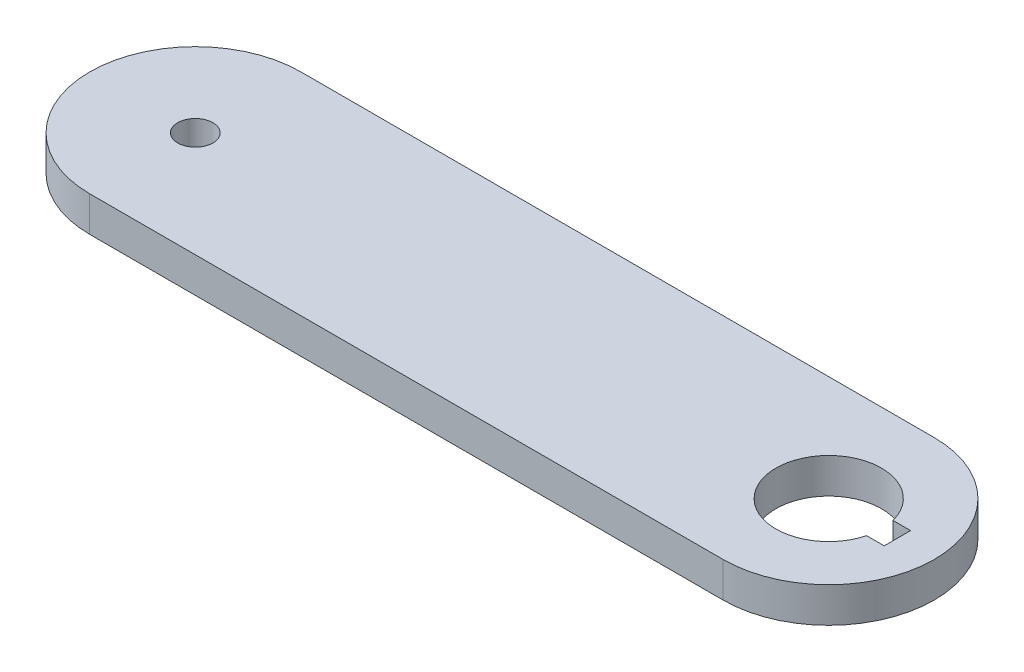
ISO-10303-21;
HEADER;
FILE_DESCRIPTION(('STEP AP214'),'2;1');
FILE_NAME('part.step','',(''),(''),'','','');
FILE_SCHEMA(('AUTOMOTIVE_DESIGN { 1 0 10303 214 1 1 1 1 }'));
ENDSEC;
DATA;
#1=APPLICATION_CONTEXT('core data for automotive mechanical design processes');
#2=APPLICATION_PROTOCOL_DEFINITION('international standard','automotive_design',2000,#1);
#3=PRODUCT_CONTEXT('',#1,'mechanical');
#4=PRODUCT('Part','Part','',(#3));
#5=PRODUCT_RELATED_PRODUCT_CATEGORY('part','',(#4));
#6=PRODUCT_DEFINITION_FORMATION('','',#4);
#7=PRODUCT_DEFINITION_CONTEXT('part definition',#1,'design');
#8=PRODUCT_DEFINITION('design','',#6,#7);
#9=PRODUCT_DEFINITION_SHAPE('','',#8);
#10=(LENGTH_UNIT() NAMED_UNIT(*) SI_UNIT(.MILLI.,.METRE.));
#11=(NAMED_UNIT(*) PLANE_ANGLE_UNIT() SI_UNIT($,.RADIAN.));
#12=(NAMED_UNIT(*) SI_UNIT($,.STERADIAN.) SOLID_ANGLE_UNIT());
#13=UNCERTAINTY_MEASURE_WITH_UNIT(LENGTH_MEASURE(1.E-05),#10,'distance_accuracy_value','');
#14=(GEOMETRIC_REPRESENTATION_CONTEXT(3) GLOBAL_UNCERTAINTY_ASSIGNED_CONTEXT((#13)) GLOBAL_UNIT_ASSIGNED_CONTEXT((#10,
#11,#12)) REPRESENTATION_CONTEXT('',''));
#15=CARTESIAN_POINT('',(0.,0.,0.));
#16=DIRECTION('',(0.,0.,1.));
#17=DIRECTION('',(1.,0.,0.));
#18=AXIS2_PLACEMENT_3D('',#15,#16,#17);
#19=CARTESIAN_POINT('',(0.,6.34999999999999,0.));
#20=DIRECTION('',(0.,1.,0.));
#21=DIRECTION('',(0.,0.,1.));
#22=AXIS2_PLACEMENT_3D('',#19,#20,#21);
#23=PLANE('',#22);
#24=CARTESIAN_POINT('',(0.,6.34999999999999,0.));
#25=DIRECTION('',(0.,1.,0.));
#26=DIRECTION('',(0.,0.,1.));
#27=AXIS2_PLACEMENT_3D('',#24,#25,#26);
#28=CIRCLE('',#27,3.175);
#29=CARTESIAN_POINT('',(0.,6.34999999999999,3.175));
#30=VERTEX_POINT('',#29);
#31=EDGE_CURVE('E263',#30,#30,#28,.T.);
#32=ORIENTED_EDGE('',*,*,#31,.F.);
#33=EDGE_LOOP('',(#32));
#34=FACE_BOUND('',#33,.T.);
#35=CARTESIAN_POINT('',(0.,6.34999999999999,0.));
#36=DIRECTION('',(0.,1.,0.));
#37=DIRECTION('',(0.,0.,1.));
#38=AXIS2_PLACEMENT_3D('',#35,#36,#37);
#39=CIRCLE('',#38,19.05);
#40=CARTESIAN_POINT('',(0.,6.35000000000001,-19.05));
#41=VERTEX_POINT('',#40);
#42=CARTESIAN_POINT('',(0.,6.34999999999999,19.05));
#43=VERTEX_POINT('',#42);
#44=EDGE_CURVE('E162',#41,#43,#39,.T.);
#45=ORIENTED_EDGE('',*,*,#44,.T.);
#46=DIRECTION('',(1.,0.,0.));
#47=VECTOR('',#46,1.);
#48=CARTESIAN_POINT('',(0.,6.34999999999999,19.05));
#49=LINE('',#48,#47);
#50=CARTESIAN_POINT('',(114.3,6.34999999999999,19.05));
#51=VERTEX_POINT('',#50);
#52=EDGE_CURVE('E166',#43,#51,#49,.T.);
#53=ORIENTED_EDGE('',*,*,#52,.T.);
#54=CARTESIAN_POINT('',(114.3,6.34999999999999,0.));
#55=DIRECTION('',(0.,1.,0.));
#56=DIRECTION('',(0.,0.,1.));
#57=AXIS2_PLACEMENT_3D('',#54,#55,#56);
#58=CIRCLE('',#57,19.05);
#59=CARTESIAN_POINT('',(114.3,6.34999999999999,-19.05));
#60=VERTEX_POINT('',#59);
#61=EDGE_CURVE('E170',#51,#60,#58,.T.);
#62=ORIENTED_EDGE('',*,*,#61,.T.);
#63=DIRECTION('',(-1.,0.,0.));
#64=VECTOR('',#63,1.);
#65=CARTESIAN_POINT('',(0.,6.35000000000001,-19.05));
#66=LINE('',#65,#64);
#67=EDGE_CURVE('E173',#60,#41,#66,.T.);
#68=ORIENTED_EDGE('',*,*,#67,.T.);
#69=EDGE_LOOP('',(#45,#53,#62,#68));
#70=FACE_BOUND('',#69,.T.);
#71=DIRECTION('',(1.,0.,0.));
#72=VECTOR('',#71,1.);
#73=CARTESIAN_POINT('',(123.522541593156,6.34999999999999,2.38124999999999));
#74=LINE('',#73,#72);
#75=CARTESIAN_POINT('',(123.522541593156,6.34999999999999,2.38124999999999));
#76=VERTEX_POINT('',#75);
#77=CARTESIAN_POINT('',(126.697541593156,6.34999999999999,2.38124999999999));
#78=VERTEX_POINT('',#77);
#79=EDGE_CURVE('E119',#76,#78,#74,.T.);
#80=ORIENTED_EDGE('',*,*,#79,.F.);
#81=CARTESIAN_POINT('',(114.3,6.34999999999999,0.));
#82=DIRECTION('',(0.,1.,0.));
#83=DIRECTION('',(0.,0.,1.));
#84=AXIS2_PLACEMENT_3D('',#81,#82,#83);
#85=CIRCLE('',#84,9.525);
#86=CARTESIAN_POINT('',(123.522541593156,6.34999999999999,-2.38125000000002));
#87=VERTEX_POINT('',#86);
#88=EDGE_CURVE('E110',#87,#76,#85,.T.);
#89=ORIENTED_EDGE('',*,*,#88,.F.);
#90=DIRECTION('',(-1.,0.,0.));
#91=VECTOR('',#90,1.);
#92=CARTESIAN_POINT('',(123.522541593156,6.34999999999999,-2.38125000000002));
#93=LINE('',#92,#91);
#94=CARTESIAN_POINT('',(126.697541593156,6.34999999999999,-2.38125));
#95=VERTEX_POINT('',#94);
#96=EDGE_CURVE('E138',#95,#87,#93,.T.);
#97=ORIENTED_EDGE('',*,*,#96,.F.);
#98=DIRECTION('',(0.,0.,-1.));
#99=VECTOR('',#98,1.);
#100=CARTESIAN_POINT('',(126.697541593156,6.34999999999999,2.38124999999999));
#101=LINE('',#100,#99);
#102=EDGE_CURVE('E132',#78,#95,#101,.T.);
#103=ORIENTED_EDGE('',*,*,#102,.F.);
#104=EDGE_LOOP('',(#80,#89,#97,#103));
#105=FACE_BOUND('',#104,.T.);
#106=ADVANCED_FACE('F44',(#34,#70,#105),#23,.T.);
#107=CARTESIAN_POINT('',(0.,0.,0.));
#108=DIRECTION('',(0.,1.,0.));
#109=DIRECTION('',(0.,0.,1.));
#110=AXIS2_PLACEMENT_3D('',#107,#108,#109);
#111=PLANE('',#110);
#112=CARTESIAN_POINT('',(0.,0.,0.));
#113=DIRECTION('',(0.,1.,0.));
#114=DIRECTION('',(0.,0.,1.));
#115=AXIS2_PLACEMENT_3D('',#112,#113,#114);
#116=CIRCLE('',#115,3.175);
#117=CARTESIAN_POINT('',(0.,0.,3.175));
#118=VERTEX_POINT('',#117);
#119=EDGE_CURVE('E146',#118,#118,#116,.T.);
#120=ORIENTED_EDGE('',*,*,#119,.T.);
#121=EDGE_LOOP('',(#120));
#122=FACE_BOUND('',#121,.T.);
#123=CARTESIAN_POINT('',(0.,0.,0.));
#124=DIRECTION('',(0.,1.,0.));
#125=DIRECTION('',(0.,0.,1.));
#126=AXIS2_PLACEMENT_3D('',#123,#124,#125);
#127=CIRCLE('',#126,19.05);
#128=CARTESIAN_POINT('',(0.,0.,-19.05));
#129=VERTEX_POINT('',#128);
#130=CARTESIAN_POINT('',(0.,0.,19.05));
#131=VERTEX_POINT('',#130);
#132=EDGE_CURVE('E128',#129,#131,#127,.T.);
#133=ORIENTED_EDGE('',*,*,#132,.F.);
#134=DIRECTION('',(-1.,0.,0.));
#135=VECTOR('',#134,1.);
#136=CARTESIAN_POINT('',(0.,0.,-19.05));
#137=LINE('',#136,#135);
#138=CARTESIAN_POINT('',(114.3,0.,-19.05));
#139=VERTEX_POINT('',#138);
#140=EDGE_CURVE('E167',#139,#129,#137,.T.);
#141=ORIENTED_EDGE('',*,*,#140,.F.);
#142=CARTESIAN_POINT('',(114.3,0.,0.));
#143=DIRECTION('',(0.,1.,0.));
#144=DIRECTION('',(0.,0.,1.));
#145=AXIS2_PLACEMENT_3D('',#142,#143,#144);
#146=CIRCLE('',#145,19.05);
#147=CARTESIAN_POINT('',(114.3,0.,19.05));
#148=VERTEX_POINT('',#147);
#149=EDGE_CURVE('E183',#148,#139,#146,.T.);
#150=ORIENTED_EDGE('',*,*,#149,.F.);
#151=DIRECTION('',(1.,0.,0.));
#152=VECTOR('',#151,1.);
#153=CARTESIAN_POINT('',(0.,0.,19.05));
#154=LINE('',#153,#152);
#155=EDGE_CURVE('E180',#131,#148,#154,.T.);
#156=ORIENTED_EDGE('',*,*,#155,.F.);
#157=EDGE_LOOP('',(#133,#141,#150,#156));
#158=FACE_BOUND('',#157,.T.);
#159=CARTESIAN_POINT('',(114.3,0.,0.));
#160=DIRECTION('',(0.,1.,0.));
#161=DIRECTION('',(0.,0.,1.));
#162=AXIS2_PLACEMENT_3D('',#159,#160,#161);
#163=CIRCLE('',#162,9.525);
#164=CARTESIAN_POINT('',(123.522541593156,0.,-2.38125000000002));
#165=VERTEX_POINT('',#164);
#166=CARTESIAN_POINT('',(123.522541593156,0.,2.38124999999999));
#167=VERTEX_POINT('',#166);
#168=EDGE_CURVE('E68',#165,#167,#163,.T.);
#169=ORIENTED_EDGE('',*,*,#168,.T.);
#170=DIRECTION('',(1.,0.,0.));
#171=VECTOR('',#170,1.);
#172=CARTESIAN_POINT('',(123.522541593156,0.,2.38124999999999));
#173=LINE('',#172,#171);
#174=CARTESIAN_POINT('',(126.697541593156,0.,2.38124999999999));
#175=VERTEX_POINT('',#174);
#176=EDGE_CURVE('E126',#167,#175,#173,.T.);
#177=ORIENTED_EDGE('',*,*,#176,.T.);
#178=DIRECTION('',(0.,0.,-1.));
#179=VECTOR('',#178,1.);
#180=CARTESIAN_POINT('',(126.697541593156,0.,2.38124999999999));
#181=LINE('',#180,#179);
#182=CARTESIAN_POINT('',(126.697541593156,0.,-2.38125));
#183=VERTEX_POINT('',#182);
#184=EDGE_CURVE('E149',#175,#183,#181,.T.);
#185=ORIENTED_EDGE('',*,*,#184,.T.);
#186=DIRECTION('',(-1.,0.,0.));
#187=VECTOR('',#186,1.);
#188=CARTESIAN_POINT('',(123.522541593156,0.,-2.38125000000002));
#189=LINE('',#188,#187);
#190=EDGE_CURVE('E120',#183,#165,#189,.T.);
#191=ORIENTED_EDGE('',*,*,#190,.T.);
#192=EDGE_LOOP('',(#169,#177,#185,#191));
#193=FACE_BOUND('',#192,.T.);
#194=ADVANCED_FACE('F208',(#122,#158,#193),#111,.F.);
#195=CARTESIAN_POINT('',(0.,6.34999999999999,0.));
#196=DIRECTION('',(0.,-1.,0.));
#197=DIRECTION('',(0.,0.,-1.));
#198=AXIS2_PLACEMENT_3D('',#195,#196,#197);
#199=CYLINDRICAL_SURFACE('',#198,19.05);
#200=ORIENTED_EDGE('',*,*,#132,.T.);
#201=DIRECTION('',(0.,-1.,0.));
#202=VECTOR('',#201,1.);
#203=CARTESIAN_POINT('',(0.,6.34999999999999,19.05));
#204=LINE('',#203,#202);
#205=EDGE_CURVE('E11',#43,#131,#204,.T.);
#206=ORIENTED_EDGE('',*,*,#205,.F.);
#207=ORIENTED_EDGE('',*,*,#44,.F.);
#208=DIRECTION('',(0.,-1.,0.));
#209=VECTOR('',#208,1.);
#210=CARTESIAN_POINT('',(0.,6.35000000000001,-19.05));
#211=LINE('',#210,#209);
#212=EDGE_CURVE('E176',#41,#129,#211,.T.);
#213=ORIENTED_EDGE('',*,*,#212,.T.);
#214=EDGE_LOOP('',(#200,#206,#207,#213));
#215=FACE_BOUND('',#214,.T.);
#216=ADVANCED_FACE('F46',(#215),#199,.T.);
#217=CARTESIAN_POINT('',(0.,6.34999999999999,19.05));
#218=DIRECTION('',(0.,0.,-1.));
#219=DIRECTION('',(-1.,0.,0.));
#220=AXIS2_PLACEMENT_3D('',#217,#218,#219);
#221=PLANE('',#220);
#222=ORIENTED_EDGE('',*,*,#155,.T.);
#223=DIRECTION('',(0.,-1.,0.));
#224=VECTOR('',#223,1.);
#225=CARTESIAN_POINT('',(114.3,6.34999999999999,19.05));
#226=LINE('',#225,#224);
#227=EDGE_CURVE('E53',#51,#148,#226,.T.);
#228=ORIENTED_EDGE('',*,*,#227,.F.);
#229=ORIENTED_EDGE('',*,*,#52,.F.);
#230=ORIENTED_EDGE('',*,*,#205,.T.);
#231=EDGE_LOOP('',(#222,#228,#229,#230));
#232=FACE_BOUND('',#231,.T.);
#233=ADVANCED_FACE('F218',(#232),#221,.F.);
#234=CARTESIAN_POINT('',(114.3,6.34999999999999,0.));
#235=DIRECTION('',(0.,-1.,0.));
#236=DIRECTION('',(0.,0.,-1.));
#237=AXIS2_PLACEMENT_3D('',#234,#235,#236);
#238=CYLINDRICAL_SURFACE('',#237,19.05);
#239=ORIENTED_EDGE('',*,*,#149,.T.);
#240=DIRECTION('',(0.,-1.,0.));
#241=VECTOR('',#240,1.);
#242=CARTESIAN_POINT('',(114.3,6.34999999999999,-19.05));
#243=LINE('',#242,#241);
#244=EDGE_CURVE('E191',#60,#139,#243,.T.);
#245=ORIENTED_EDGE('',*,*,#244,.F.);
#246=ORIENTED_EDGE('',*,*,#61,.F.);
#247=ORIENTED_EDGE('',*,*,#227,.T.);
#248=EDGE_LOOP('',(#239,#245,#246,#247));
#249=FACE_BOUND('',#248,.T.);
#250=ADVANCED_FACE('F202',(#249),#238,.T.);
#251=CARTESIAN_POINT('',(0.,6.35000000000001,-19.05));
#252=DIRECTION('',(0.,0.,1.));
#253=DIRECTION('',(1.,0.,0.));
#254=AXIS2_PLACEMENT_3D('',#251,#252,#253);
#255=PLANE('',#254);
#256=ORIENTED_EDGE('',*,*,#140,.T.);
#257=ORIENTED_EDGE('',*,*,#212,.F.);
#258=ORIENTED_EDGE('',*,*,#67,.F.);
#259=ORIENTED_EDGE('',*,*,#244,.T.);
#260=EDGE_LOOP('',(#256,#257,#258,#259));
#261=FACE_BOUND('',#260,.T.);
#262=ADVANCED_FACE('F212',(#261),#255,.F.);
#263=CARTESIAN_POINT('',(114.3,6.34999999999999,0.));
#264=DIRECTION('',(0.,-1.,0.));
#265=DIRECTION('',(0.,0.,-1.));
#266=AXIS2_PLACEMENT_3D('',#263,#264,#265);
#267=CYLINDRICAL_SURFACE('',#266,9.525);
#268=ORIENTED_EDGE('',*,*,#168,.F.);
#269=DIRECTION('',(0.,-1.,0.));
#270=VECTOR('',#269,1.);
#271=CARTESIAN_POINT('',(123.522541593156,6.34999999999999,-2.38125000000002));
#272=LINE('',#271,#270);
#273=EDGE_CURVE('E114',#87,#165,#272,.T.);
#274=ORIENTED_EDGE('',*,*,#273,.F.);
#275=ORIENTED_EDGE('',*,*,#88,.T.);
#276=DIRECTION('',(0.,-1.,0.));
#277=VECTOR('',#276,1.);
#278=CARTESIAN_POINT('',(123.522541593156,6.34999999999999,2.38124999999999));
#279=LINE('',#278,#277);
#280=EDGE_CURVE('E113',#76,#167,#279,.T.);
#281=ORIENTED_EDGE('',*,*,#280,.T.);
#282=EDGE_LOOP('',(#268,#274,#275,#281));
#283=FACE_BOUND('',#282,.T.);
#284=ADVANCED_FACE('F112',(#283),#267,.F.);
#285=CARTESIAN_POINT('',(123.522541593156,6.34999999999999,2.38124999999999));
#286=DIRECTION('',(0.,0.,-1.));
#287=DIRECTION('',(-1.,0.,0.));
#288=AXIS2_PLACEMENT_3D('',#285,#286,#287);
#289=PLANE('',#288);
#290=ORIENTED_EDGE('',*,*,#176,.F.);
#291=ORIENTED_EDGE('',*,*,#280,.F.);
#292=ORIENTED_EDGE('',*,*,#79,.T.);
#293=DIRECTION('',(0.,-1.,0.));
#294=VECTOR('',#293,1.);
#295=CARTESIAN_POINT('',(126.697541593156,6.34999999999999,2.38124999999999));
#296=LINE('',#295,#294);
#297=EDGE_CURVE('E129',#78,#175,#296,.T.);
#298=ORIENTED_EDGE('',*,*,#297,.T.);
#299=EDGE_LOOP('',(#290,#291,#292,#298));
#300=FACE_BOUND('',#299,.T.);
#301=ADVANCED_FACE('F123',(#300),#289,.T.);
#302=CARTESIAN_POINT('',(126.697541593156,6.34999999999999,2.38124999999999));
#303=DIRECTION('',(-1.,0.,0.));
#304=DIRECTION('',(0.,0.,1.));
#305=AXIS2_PLACEMENT_3D('',#302,#303,#304);
#306=PLANE('',#305);
#307=ORIENTED_EDGE('',*,*,#184,.F.);
#308=ORIENTED_EDGE('',*,*,#297,.F.);
#309=ORIENTED_EDGE('',*,*,#102,.T.);
#310=DIRECTION('',(0.,-1.,0.));
#311=VECTOR('',#310,1.);
#312=CARTESIAN_POINT('',(126.697541593156,6.34999999999999,-2.38125));
#313=LINE('',#312,#311);
#314=EDGE_CURVE('E60',#95,#183,#313,.T.);
#315=ORIENTED_EDGE('',*,*,#314,.T.);
#316=EDGE_LOOP('',(#307,#308,#309,#315));
#317=FACE_BOUND('',#316,.T.);
#318=ADVANCED_FACE('F244',(#317),#306,.T.);
#319=CARTESIAN_POINT('',(123.522541593156,6.34999999999999,-2.38125000000002));
#320=DIRECTION('',(0.,0.,1.));
#321=DIRECTION('',(1.,0.,0.));
#322=AXIS2_PLACEMENT_3D('',#319,#320,#321);
#323=PLANE('',#322);
#324=ORIENTED_EDGE('',*,*,#190,.F.);
#325=ORIENTED_EDGE('',*,*,#314,.F.);
#326=ORIENTED_EDGE('',*,*,#96,.T.);
#327=ORIENTED_EDGE('',*,*,#273,.T.);
#328=EDGE_LOOP('',(#324,#325,#326,#327));
#329=FACE_BOUND('',#328,.T.);
#330=ADVANCED_FACE('F248',(#329),#323,.T.);
#331=CARTESIAN_POINT('',(0.,0.,0.));
#332=DIRECTION('',(0.,1.,0.));
#333=DIRECTION('',(0.,0.,1.));
#334=AXIS2_PLACEMENT_3D('',#331,#332,#333);
#335=CYLINDRICAL_SURFACE('',#334,3.175);
#336=ORIENTED_EDGE('',*,*,#119,.F.);
#337=EDGE_LOOP('',(#336));
#338=FACE_BOUND('',#337,.T.);
#339=ORIENTED_EDGE('',*,*,#31,.T.);
#340=EDGE_LOOP('',(#339));
#341=FACE_BOUND('',#340,.T.);
#342=ADVANCED_FACE('F254',(#338,#341),#335,.F.);
#343=CLOSED_SHELL('',(#106,#194,#216,#233,#250,#262,#284,#301,#318,#330,#342));
#344=MANIFOLD_SOLID_BREP('B2',#343);
#345=ADVANCED_BREP_SHAPE_REPRESENTATION('',(#18,#344),#14);
#346=SHAPE_DEFINITION_REPRESENTATION(#9,#345);
ENDSEC;
END-ISO-10303-21;
